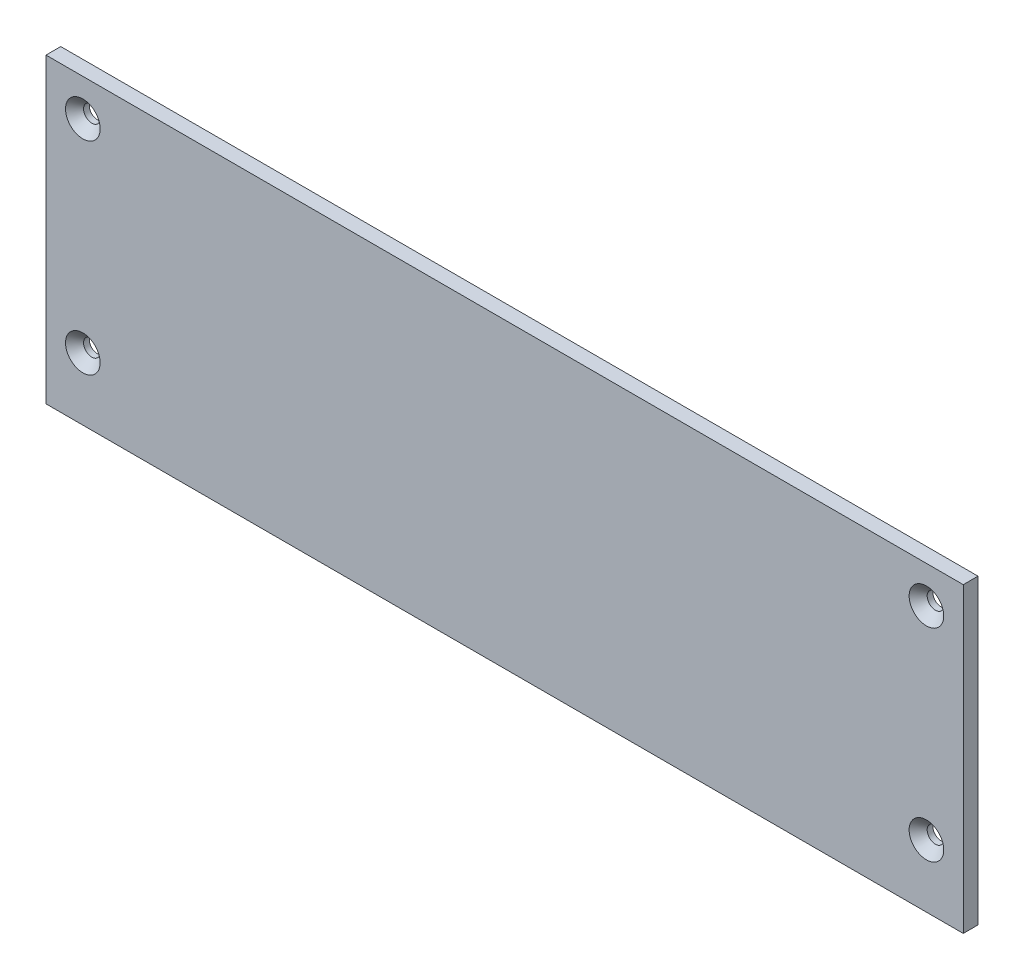
ISO-10303-21;
HEADER;
FILE_DESCRIPTION(('STEP AP214'),'2;1');
FILE_NAME('part.step','',(''),(''),'','','');
FILE_SCHEMA(('AUTOMOTIVE_DESIGN { 1 0 10303 214 1 1 1 1 }'));
ENDSEC;
DATA;
#1=APPLICATION_CONTEXT('core data for automotive mechanical design processes');
#2=APPLICATION_PROTOCOL_DEFINITION('international standard','automotive_design',2000,#1);
#3=PRODUCT_CONTEXT('',#1,'mechanical');
#4=PRODUCT('Part','Part','',(#3));
#5=PRODUCT_RELATED_PRODUCT_CATEGORY('part','',(#4));
#6=PRODUCT_DEFINITION_FORMATION('','',#4);
#7=PRODUCT_DEFINITION_CONTEXT('part definition',#1,'design');
#8=PRODUCT_DEFINITION('design','',#6,#7);
#9=PRODUCT_DEFINITION_SHAPE('','',#8);
#10=(LENGTH_UNIT() NAMED_UNIT(*) SI_UNIT(.MILLI.,.METRE.));
#11=(NAMED_UNIT(*) PLANE_ANGLE_UNIT() SI_UNIT($,.RADIAN.));
#12=(NAMED_UNIT(*) SI_UNIT($,.STERADIAN.) SOLID_ANGLE_UNIT());
#13=UNCERTAINTY_MEASURE_WITH_UNIT(LENGTH_MEASURE(1.E-05),#10,'distance_accuracy_value','');
#14=(GEOMETRIC_REPRESENTATION_CONTEXT(3) GLOBAL_UNCERTAINTY_ASSIGNED_CONTEXT((#13)) GLOBAL_UNIT_ASSIGNED_CONTEXT((#10,
#11,#12)) REPRESENTATION_CONTEXT('',''));
#15=CARTESIAN_POINT('',(0.,0.,0.));
#16=DIRECTION('',(0.,0.,1.));
#17=DIRECTION('',(1.,0.,0.));
#18=AXIS2_PLACEMENT_3D('',#15,#16,#17);
#19=CARTESIAN_POINT('',(-124.5,41.,4.));
#20=DIRECTION('',(0.,-1.,0.));
#21=DIRECTION('',(0.,0.,-1.));
#22=AXIS2_PLACEMENT_3D('',#19,#20,#21);
#23=PLANE('',#22);
#24=DIRECTION('',(-1.,0.,0.));
#25=VECTOR('',#24,1.);
#26=CARTESIAN_POINT('',(-124.5,41.,0.));
#27=LINE('',#26,#25);
#28=CARTESIAN_POINT('',(124.5,41.,0.));
#29=VERTEX_POINT('',#28);
#30=CARTESIAN_POINT('',(-124.5,41.,0.));
#31=VERTEX_POINT('',#30);
#32=EDGE_CURVE('E102',#29,#31,#27,.T.);
#33=ORIENTED_EDGE('',*,*,#32,.T.);
#34=DIRECTION('',(0.,0.,-1.));
#35=VECTOR('',#34,1.);
#36=CARTESIAN_POINT('',(-124.5,41.,4.));
#37=LINE('',#36,#35);
#38=CARTESIAN_POINT('',(-124.5,41.,4.));
#39=VERTEX_POINT('',#38);
#40=EDGE_CURVE('E11',#39,#31,#37,.T.);
#41=ORIENTED_EDGE('',*,*,#40,.F.);
#42=DIRECTION('',(-1.,0.,0.));
#43=VECTOR('',#42,1.);
#44=CARTESIAN_POINT('',(-124.5,41.,4.));
#45=LINE('',#44,#43);
#46=CARTESIAN_POINT('',(124.5,41.,4.));
#47=VERTEX_POINT('',#46);
#48=EDGE_CURVE('E90',#47,#39,#45,.T.);
#49=ORIENTED_EDGE('',*,*,#48,.F.);
#50=DIRECTION('',(0.,0.,-1.));
#51=VECTOR('',#50,1.);
#52=CARTESIAN_POINT('',(124.5,41.,4.));
#53=LINE('',#52,#51);
#54=EDGE_CURVE('E98',#47,#29,#53,.T.);
#55=ORIENTED_EDGE('',*,*,#54,.T.);
#56=EDGE_LOOP('',(#33,#41,#49,#55));
#57=FACE_BOUND('',#56,.T.);
#58=ADVANCED_FACE('F39',(#57),#23,.F.);
#59=CARTESIAN_POINT('',(-124.5,41.,4.));
#60=DIRECTION('',(1.,0.,0.));
#61=DIRECTION('',(0.,0.,-1.));
#62=AXIS2_PLACEMENT_3D('',#59,#60,#61);
#63=PLANE('',#62);
#64=DIRECTION('',(0.,-1.,0.));
#65=VECTOR('',#64,1.);
#66=CARTESIAN_POINT('',(-124.5,41.,0.));
#67=LINE('',#66,#65);
#68=CARTESIAN_POINT('',(-124.5,-41.,0.));
#69=VERTEX_POINT('',#68);
#70=EDGE_CURVE('E94',#31,#69,#67,.T.);
#71=ORIENTED_EDGE('',*,*,#70,.T.);
#72=DIRECTION('',(0.,0.,-1.));
#73=VECTOR('',#72,1.);
#74=CARTESIAN_POINT('',(-124.5,-41.,4.));
#75=LINE('',#74,#73);
#76=CARTESIAN_POINT('',(-124.5,-41.,4.));
#77=VERTEX_POINT('',#76);
#78=EDGE_CURVE('E47',#77,#69,#75,.T.);
#79=ORIENTED_EDGE('',*,*,#78,.F.);
#80=DIRECTION('',(0.,-1.,0.));
#81=VECTOR('',#80,1.);
#82=CARTESIAN_POINT('',(-124.5,41.,4.));
#83=LINE('',#82,#81);
#84=EDGE_CURVE('E85',#39,#77,#83,.T.);
#85=ORIENTED_EDGE('',*,*,#84,.F.);
#86=ORIENTED_EDGE('',*,*,#40,.T.);
#87=EDGE_LOOP('',(#71,#79,#85,#86));
#88=FACE_BOUND('',#87,.T.);
#89=ADVANCED_FACE('F93',(#88),#63,.F.);
#90=CARTESIAN_POINT('',(-124.5,-41.,4.));
#91=DIRECTION('',(0.,1.,0.));
#92=DIRECTION('',(0.,0.,1.));
#93=AXIS2_PLACEMENT_3D('',#90,#91,#92);
#94=PLANE('',#93);
#95=DIRECTION('',(1.,0.,0.));
#96=VECTOR('',#95,1.);
#97=CARTESIAN_POINT('',(-124.5,-41.,0.));
#98=LINE('',#97,#96);
#99=CARTESIAN_POINT('',(124.5,-41.,0.));
#100=VERTEX_POINT('',#99);
#101=EDGE_CURVE('E72',#69,#100,#98,.T.);
#102=ORIENTED_EDGE('',*,*,#101,.T.);
#103=DIRECTION('',(0.,0.,-1.));
#104=VECTOR('',#103,1.);
#105=CARTESIAN_POINT('',(124.5,-41.,4.));
#106=LINE('',#105,#104);
#107=CARTESIAN_POINT('',(124.5,-41.,4.));
#108=VERTEX_POINT('',#107);
#109=EDGE_CURVE('E95',#108,#100,#106,.T.);
#110=ORIENTED_EDGE('',*,*,#109,.F.);
#111=DIRECTION('',(1.,0.,0.));
#112=VECTOR('',#111,1.);
#113=CARTESIAN_POINT('',(-124.5,-41.,4.));
#114=LINE('',#113,#112);
#115=EDGE_CURVE('E88',#77,#108,#114,.T.);
#116=ORIENTED_EDGE('',*,*,#115,.F.);
#117=ORIENTED_EDGE('',*,*,#78,.T.);
#118=EDGE_LOOP('',(#102,#110,#116,#117));
#119=FACE_BOUND('',#118,.T.);
#120=ADVANCED_FACE('F96',(#119),#94,.F.);
#121=CARTESIAN_POINT('',(124.5,41.,4.));
#122=DIRECTION('',(-1.,0.,0.));
#123=DIRECTION('',(0.,0.,1.));
#124=AXIS2_PLACEMENT_3D('',#121,#122,#123);
#125=PLANE('',#124);
#126=DIRECTION('',(0.,1.,0.));
#127=VECTOR('',#126,1.);
#128=CARTESIAN_POINT('',(124.5,41.,0.));
#129=LINE('',#128,#127);
#130=EDGE_CURVE('E78',#100,#29,#129,.T.);
#131=ORIENTED_EDGE('',*,*,#130,.T.);
#132=ORIENTED_EDGE('',*,*,#54,.F.);
#133=DIRECTION('',(0.,1.,0.));
#134=VECTOR('',#133,1.);
#135=CARTESIAN_POINT('',(124.5,41.,4.));
#136=LINE('',#135,#134);
#137=EDGE_CURVE('E55',#108,#47,#136,.T.);
#138=ORIENTED_EDGE('',*,*,#137,.F.);
#139=ORIENTED_EDGE('',*,*,#109,.T.);
#140=EDGE_LOOP('',(#131,#132,#138,#139));
#141=FACE_BOUND('',#140,.T.);
#142=ADVANCED_FACE('F110',(#141),#125,.F.);
#143=CARTESIAN_POINT('',(0.,0.,4.));
#144=DIRECTION('',(0.,0.,-1.));
#145=DIRECTION('',(-1.,0.,0.));
#146=AXIS2_PLACEMENT_3D('',#143,#144,#145);
#147=PLANE('',#146);
#148=CARTESIAN_POINT('',(114.5,-24.,4.));
#149=DIRECTION('',(0.,0.,1.));
#150=DIRECTION('',(1.,0.,0.));
#151=AXIS2_PLACEMENT_3D('',#148,#149,#150);
#152=CIRCLE('',#151,4.7);
#153=CARTESIAN_POINT('',(119.2,-24.,4.));
#154=VERTEX_POINT('',#153);
#155=EDGE_CURVE('E148',#154,#154,#152,.T.);
#156=ORIENTED_EDGE('',*,*,#155,.F.);
#157=EDGE_LOOP('',(#156));
#158=FACE_BOUND('',#157,.T.);
#159=CARTESIAN_POINT('',(114.5,31.,4.));
#160=DIRECTION('',(0.,0.,1.));
#161=DIRECTION('',(1.,0.,0.));
#162=AXIS2_PLACEMENT_3D('',#159,#160,#161);
#163=CIRCLE('',#162,4.7);
#164=CARTESIAN_POINT('',(119.2,31.,4.));
#165=VERTEX_POINT('',#164);
#166=EDGE_CURVE('E139',#165,#165,#163,.T.);
#167=ORIENTED_EDGE('',*,*,#166,.F.);
#168=EDGE_LOOP('',(#167));
#169=FACE_BOUND('',#168,.T.);
#170=CARTESIAN_POINT('',(-114.5,31.,4.));
#171=DIRECTION('',(0.,0.,1.));
#172=DIRECTION('',(1.,0.,0.));
#173=AXIS2_PLACEMENT_3D('',#170,#171,#172);
#174=CIRCLE('',#173,4.7);
#175=CARTESIAN_POINT('',(-109.8,31.,4.));
#176=VERTEX_POINT('',#175);
#177=EDGE_CURVE('E130',#176,#176,#174,.T.);
#178=ORIENTED_EDGE('',*,*,#177,.F.);
#179=EDGE_LOOP('',(#178));
#180=FACE_BOUND('',#179,.T.);
#181=CARTESIAN_POINT('',(-114.5,-24.,4.));
#182=DIRECTION('',(0.,0.,1.));
#183=DIRECTION('',(1.,0.,0.));
#184=AXIS2_PLACEMENT_3D('',#181,#182,#183);
#185=CIRCLE('',#184,4.7);
#186=CARTESIAN_POINT('',(-109.8,-24.,4.));
#187=VERTEX_POINT('',#186);
#188=EDGE_CURVE('E121',#187,#187,#185,.T.);
#189=ORIENTED_EDGE('',*,*,#188,.F.);
#190=EDGE_LOOP('',(#189));
#191=FACE_BOUND('',#190,.T.);
#192=ORIENTED_EDGE('',*,*,#48,.T.);
#193=ORIENTED_EDGE('',*,*,#84,.T.);
#194=ORIENTED_EDGE('',*,*,#115,.T.);
#195=ORIENTED_EDGE('',*,*,#137,.T.);
#196=EDGE_LOOP('',(#192,#193,#194,#195));
#197=FACE_BOUND('',#196,.T.);
#198=ADVANCED_FACE('F86',(#158,#169,#180,#191,#197),#147,.F.);
#199=CARTESIAN_POINT('',(0.,0.,0.));
#200=DIRECTION('',(0.,0.,-1.));
#201=DIRECTION('',(-1.,0.,0.));
#202=AXIS2_PLACEMENT_3D('',#199,#200,#201);
#203=PLANE('',#202);
#204=CARTESIAN_POINT('',(114.5,-24.,0.));
#205=DIRECTION('',(0.,0.,1.));
#206=DIRECTION('',(1.,0.,0.));
#207=AXIS2_PLACEMENT_3D('',#204,#205,#206);
#208=CIRCLE('',#207,2.25);
#209=CARTESIAN_POINT('',(116.75,-24.,0.));
#210=VERTEX_POINT('',#209);
#211=EDGE_CURVE('E142',#210,#210,#208,.T.);
#212=ORIENTED_EDGE('',*,*,#211,.T.);
#213=EDGE_LOOP('',(#212));
#214=FACE_BOUND('',#213,.T.);
#215=CARTESIAN_POINT('',(114.5,31.,0.));
#216=DIRECTION('',(0.,0.,1.));
#217=DIRECTION('',(1.,0.,0.));
#218=AXIS2_PLACEMENT_3D('',#215,#216,#217);
#219=CIRCLE('',#218,2.25);
#220=CARTESIAN_POINT('',(116.75,31.,0.));
#221=VERTEX_POINT('',#220);
#222=EDGE_CURVE('E133',#221,#221,#219,.T.);
#223=ORIENTED_EDGE('',*,*,#222,.T.);
#224=EDGE_LOOP('',(#223));
#225=FACE_BOUND('',#224,.T.);
#226=CARTESIAN_POINT('',(-114.5,31.,0.));
#227=DIRECTION('',(0.,0.,1.));
#228=DIRECTION('',(1.,0.,0.));
#229=AXIS2_PLACEMENT_3D('',#226,#227,#228);
#230=CIRCLE('',#229,2.25);
#231=CARTESIAN_POINT('',(-112.25,31.,0.));
#232=VERTEX_POINT('',#231);
#233=EDGE_CURVE('E124',#232,#232,#230,.T.);
#234=ORIENTED_EDGE('',*,*,#233,.T.);
#235=EDGE_LOOP('',(#234));
#236=FACE_BOUND('',#235,.T.);
#237=CARTESIAN_POINT('',(-114.5,-24.,0.));
#238=DIRECTION('',(0.,0.,1.));
#239=DIRECTION('',(1.,0.,0.));
#240=AXIS2_PLACEMENT_3D('',#237,#238,#239);
#241=CIRCLE('',#240,2.25);
#242=CARTESIAN_POINT('',(-112.25,-24.,0.));
#243=VERTEX_POINT('',#242);
#244=EDGE_CURVE('E105',#243,#243,#241,.T.);
#245=ORIENTED_EDGE('',*,*,#244,.T.);
#246=EDGE_LOOP('',(#245));
#247=FACE_BOUND('',#246,.T.);
#248=ORIENTED_EDGE('',*,*,#32,.F.);
#249=ORIENTED_EDGE('',*,*,#130,.F.);
#250=ORIENTED_EDGE('',*,*,#101,.F.);
#251=ORIENTED_EDGE('',*,*,#70,.F.);
#252=EDGE_LOOP('',(#248,#249,#250,#251));
#253=FACE_BOUND('',#252,.T.);
#254=ADVANCED_FACE('F113',(#214,#225,#236,#247,#253),#203,.T.);
#255=CARTESIAN_POINT('',(-114.5,-24.,4.));
#256=DIRECTION('',(0.,0.,1.));
#257=DIRECTION('',(1.,0.,0.));
#258=AXIS2_PLACEMENT_3D('',#255,#256,#257);
#259=CYLINDRICAL_SURFACE('',#258,2.25);
#260=ORIENTED_EDGE('',*,*,#244,.F.);
#261=EDGE_LOOP('',(#260));
#262=FACE_BOUND('',#261,.T.);
#263=CARTESIAN_POINT('',(-114.5,-24.,1.54999999999999));
#264=DIRECTION('',(0.,0.,1.));
#265=DIRECTION('',(1.,0.,0.));
#266=AXIS2_PLACEMENT_3D('',#263,#264,#265);
#267=CIRCLE('',#266,2.24999999999999);
#268=CARTESIAN_POINT('',(-112.25,-24.,1.54999999999999));
#269=VERTEX_POINT('',#268);
#270=EDGE_CURVE('E118',#269,#269,#267,.T.);
#271=ORIENTED_EDGE('',*,*,#270,.T.);
#272=EDGE_LOOP('',(#271));
#273=FACE_BOUND('',#272,.T.);
#274=ADVANCED_FACE('F166',(#262,#273),#259,.F.);
#275=CARTESIAN_POINT('',(-114.5,-24.,4.));
#276=DIRECTION('',(0.,0.,1.));
#277=DIRECTION('',(1.,0.,0.));
#278=AXIS2_PLACEMENT_3D('',#275,#276,#277);
#279=CONICAL_SURFACE('',#278,4.7,0.785398163397448);
#280=ORIENTED_EDGE('',*,*,#270,.F.);
#281=EDGE_LOOP('',(#280));
#282=FACE_BOUND('',#281,.T.);
#283=ORIENTED_EDGE('',*,*,#188,.T.);
#284=EDGE_LOOP('',(#283));
#285=FACE_BOUND('',#284,.T.);
#286=ADVANCED_FACE('F163',(#282,#285),#279,.F.);
#287=CARTESIAN_POINT('',(-114.5,31.,4.));
#288=DIRECTION('',(0.,0.,1.));
#289=DIRECTION('',(1.,0.,0.));
#290=AXIS2_PLACEMENT_3D('',#287,#288,#289);
#291=CYLINDRICAL_SURFACE('',#290,2.25);
#292=ORIENTED_EDGE('',*,*,#233,.F.);
#293=EDGE_LOOP('',(#292));
#294=FACE_BOUND('',#293,.T.);
#295=CARTESIAN_POINT('',(-114.5,31.,1.54999999999999));
#296=DIRECTION('',(0.,0.,1.));
#297=DIRECTION('',(1.,0.,0.));
#298=AXIS2_PLACEMENT_3D('',#295,#296,#297);
#299=CIRCLE('',#298,2.24999999999999);
#300=CARTESIAN_POINT('',(-112.25,31.,1.54999999999999));
#301=VERTEX_POINT('',#300);
#302=EDGE_CURVE('E127',#301,#301,#299,.T.);
#303=ORIENTED_EDGE('',*,*,#302,.T.);
#304=EDGE_LOOP('',(#303));
#305=FACE_BOUND('',#304,.T.);
#306=ADVANCED_FACE('F165',(#294,#305),#291,.F.);
#307=CARTESIAN_POINT('',(-114.5,31.,4.));
#308=DIRECTION('',(0.,0.,1.));
#309=DIRECTION('',(1.,0.,0.));
#310=AXIS2_PLACEMENT_3D('',#307,#308,#309);
#311=CONICAL_SURFACE('',#310,4.7,0.785398163397448);
#312=ORIENTED_EDGE('',*,*,#302,.F.);
#313=EDGE_LOOP('',(#312));
#314=FACE_BOUND('',#313,.T.);
#315=ORIENTED_EDGE('',*,*,#177,.T.);
#316=EDGE_LOOP('',(#315));
#317=FACE_BOUND('',#316,.T.);
#318=ADVANCED_FACE('F173',(#314,#317),#311,.F.);
#319=CARTESIAN_POINT('',(114.5,31.,4.));
#320=DIRECTION('',(0.,0.,1.));
#321=DIRECTION('',(1.,0.,0.));
#322=AXIS2_PLACEMENT_3D('',#319,#320,#321);
#323=CYLINDRICAL_SURFACE('',#322,2.25);
#324=ORIENTED_EDGE('',*,*,#222,.F.);
#325=EDGE_LOOP('',(#324));
#326=FACE_BOUND('',#325,.T.);
#327=CARTESIAN_POINT('',(114.5,31.,1.54999999999999));
#328=DIRECTION('',(0.,0.,1.));
#329=DIRECTION('',(1.,0.,0.));
#330=AXIS2_PLACEMENT_3D('',#327,#328,#329);
#331=CIRCLE('',#330,2.24999999999999);
#332=CARTESIAN_POINT('',(116.75,31.,1.54999999999999));
#333=VERTEX_POINT('',#332);
#334=EDGE_CURVE('E136',#333,#333,#331,.T.);
#335=ORIENTED_EDGE('',*,*,#334,.T.);
#336=EDGE_LOOP('',(#335));
#337=FACE_BOUND('',#336,.T.);
#338=ADVANCED_FACE('F207',(#326,#337),#323,.F.);
#339=CARTESIAN_POINT('',(114.5,31.,4.));
#340=DIRECTION('',(0.,0.,1.));
#341=DIRECTION('',(1.,0.,0.));
#342=AXIS2_PLACEMENT_3D('',#339,#340,#341);
#343=CONICAL_SURFACE('',#342,4.7,0.785398163397448);
#344=ORIENTED_EDGE('',*,*,#334,.F.);
#345=EDGE_LOOP('',(#344));
#346=FACE_BOUND('',#345,.T.);
#347=ORIENTED_EDGE('',*,*,#166,.T.);
#348=EDGE_LOOP('',(#347));
#349=FACE_BOUND('',#348,.T.);
#350=ADVANCED_FACE('F212',(#346,#349),#343,.F.);
#351=CARTESIAN_POINT('',(114.5,-24.,4.));
#352=DIRECTION('',(0.,0.,1.));
#353=DIRECTION('',(1.,0.,0.));
#354=AXIS2_PLACEMENT_3D('',#351,#352,#353);
#355=CYLINDRICAL_SURFACE('',#354,2.25);
#356=ORIENTED_EDGE('',*,*,#211,.F.);
#357=EDGE_LOOP('',(#356));
#358=FACE_BOUND('',#357,.T.);
#359=CARTESIAN_POINT('',(114.5,-24.,1.54999999999999));
#360=DIRECTION('',(0.,0.,1.));
#361=DIRECTION('',(1.,0.,0.));
#362=AXIS2_PLACEMENT_3D('',#359,#360,#361);
#363=CIRCLE('',#362,2.24999999999999);
#364=CARTESIAN_POINT('',(116.75,-24.,1.54999999999999));
#365=VERTEX_POINT('',#364);
#366=EDGE_CURVE('E145',#365,#365,#363,.T.);
#367=ORIENTED_EDGE('',*,*,#366,.T.);
#368=EDGE_LOOP('',(#367));
#369=FACE_BOUND('',#368,.T.);
#370=ADVANCED_FACE('F218',(#358,#369),#355,.F.);
#371=CARTESIAN_POINT('',(114.5,-24.,4.));
#372=DIRECTION('',(0.,0.,1.));
#373=DIRECTION('',(1.,0.,0.));
#374=AXIS2_PLACEMENT_3D('',#371,#372,#373);
#375=CONICAL_SURFACE('',#374,4.7,0.785398163397448);
#376=ORIENTED_EDGE('',*,*,#366,.F.);
#377=EDGE_LOOP('',(#376));
#378=FACE_BOUND('',#377,.T.);
#379=ORIENTED_EDGE('',*,*,#155,.T.);
#380=EDGE_LOOP('',(#379));
#381=FACE_BOUND('',#380,.T.);
#382=ADVANCED_FACE('F152',(#378,#381),#375,.F.);
#383=CLOSED_SHELL('',(#58,#89,#120,#142,#198,#254,#274,#286,#306,#318,#338,#350,#370,#382));
#384=MANIFOLD_SOLID_BREP('B2',#383);
#385=ADVANCED_BREP_SHAPE_REPRESENTATION('',(#18,#384),#14);
#386=SHAPE_DEFINITION_REPRESENTATION(#9,#385);
ENDSEC;
END-ISO-10303-21;
